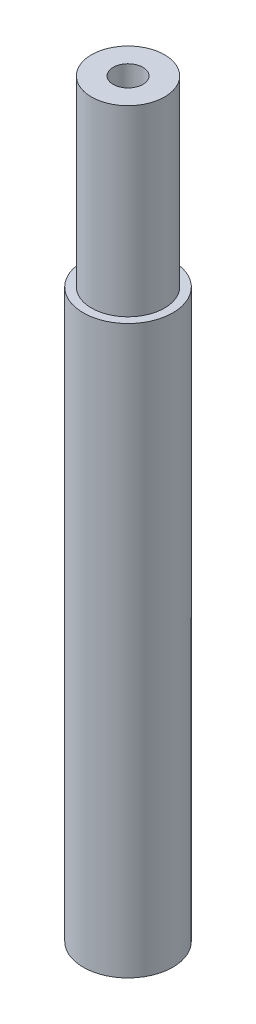
ISO-10303-21;
HEADER;
FILE_DESCRIPTION(('STEP AP214'),'2;1');
FILE_NAME('part.step','',(''),(''),'','','');
FILE_SCHEMA(('AUTOMOTIVE_DESIGN { 1 0 10303 214 1 1 1 1 }'));
ENDSEC;
DATA;
#1=APPLICATION_CONTEXT('core data for automotive mechanical design processes');
#2=APPLICATION_PROTOCOL_DEFINITION('international standard','automotive_design',2000,#1);
#3=PRODUCT_CONTEXT('',#1,'mechanical');
#4=PRODUCT('Part','Part','',(#3));
#5=PRODUCT_RELATED_PRODUCT_CATEGORY('part','',(#4));
#6=PRODUCT_DEFINITION_FORMATION('','',#4);
#7=PRODUCT_DEFINITION_CONTEXT('part definition',#1,'design');
#8=PRODUCT_DEFINITION('design','',#6,#7);
#9=PRODUCT_DEFINITION_SHAPE('','',#8);
#10=(LENGTH_UNIT() NAMED_UNIT(*) SI_UNIT(.MILLI.,.METRE.));
#11=(NAMED_UNIT(*) PLANE_ANGLE_UNIT() SI_UNIT($,.RADIAN.));
#12=(NAMED_UNIT(*) SI_UNIT($,.STERADIAN.) SOLID_ANGLE_UNIT());
#13=UNCERTAINTY_MEASURE_WITH_UNIT(LENGTH_MEASURE(1.E-05),#10,'distance_accuracy_value','');
#14=(GEOMETRIC_REPRESENTATION_CONTEXT(3) GLOBAL_UNCERTAINTY_ASSIGNED_CONTEXT((#13)) GLOBAL_UNIT_ASSIGNED_CONTEXT((#10,
#11,#12)) REPRESENTATION_CONTEXT('',''));
#15=CARTESIAN_POINT('',(0.,0.,0.));
#16=DIRECTION('',(0.,0.,1.));
#17=DIRECTION('',(1.,0.,0.));
#18=AXIS2_PLACEMENT_3D('',#15,#16,#17);
#19=CARTESIAN_POINT('',(0.,20.,0.));
#20=DIRECTION('',(0.,1.,0.));
#21=DIRECTION('',(0.,0.,1.));
#22=AXIS2_PLACEMENT_3D('',#19,#20,#21);
#23=PLANE('',#22);
#24=CARTESIAN_POINT('',(0.,20.,0.));
#25=DIRECTION('',(0.,1.,0.));
#26=DIRECTION('',(0.,0.,1.));
#27=AXIS2_PLACEMENT_3D('',#24,#25,#26);
#28=CIRCLE('',#27,4.);
#29=CARTESIAN_POINT('',(0.,20.,4.));
#30=VERTEX_POINT('',#29);
#31=EDGE_CURVE('E10',#30,#30,#28,.T.);
#32=ORIENTED_EDGE('',*,*,#31,.T.);
#33=EDGE_LOOP('',(#32));
#34=FACE_BOUND('',#33,.T.);
#35=CARTESIAN_POINT('',(0.,20.,0.));
#36=DIRECTION('',(0.,1.,0.));
#37=DIRECTION('',(0.,0.,1.));
#38=AXIS2_PLACEMENT_3D('',#35,#36,#37);
#39=CIRCLE('',#38,1.625);
#40=CARTESIAN_POINT('',(0.,20.,1.625));
#41=VERTEX_POINT('',#40);
#42=EDGE_CURVE('E46',#41,#41,#39,.T.);
#43=ORIENTED_EDGE('',*,*,#42,.F.);
#44=EDGE_LOOP('',(#43));
#45=FACE_BOUND('',#44,.T.);
#46=ADVANCED_FACE('F37',(#34,#45),#23,.T.);
#47=CARTESIAN_POINT('',(0.,20.,0.));
#48=DIRECTION('',(0.,-1.,0.));
#49=DIRECTION('',(0.,0.,-1.));
#50=AXIS2_PLACEMENT_3D('',#47,#48,#49);
#51=CYLINDRICAL_SURFACE('',#50,4.);
#52=ORIENTED_EDGE('',*,*,#31,.F.);
#53=EDGE_LOOP('',(#52));
#54=FACE_BOUND('',#53,.T.);
#55=CARTESIAN_POINT('',(0.,0.,0.));
#56=DIRECTION('',(0.,1.,0.));
#57=DIRECTION('',(0.,0.,1.));
#58=AXIS2_PLACEMENT_3D('',#55,#56,#57);
#59=CIRCLE('',#58,4.);
#60=CARTESIAN_POINT('',(0.,0.,4.));
#61=VERTEX_POINT('',#60);
#62=EDGE_CURVE('E41',#61,#61,#59,.T.);
#63=ORIENTED_EDGE('',*,*,#62,.T.);
#64=EDGE_LOOP('',(#63));
#65=FACE_BOUND('',#64,.T.);
#66=ADVANCED_FACE('F39',(#54,#65),#51,.T.);
#67=CARTESIAN_POINT('',(0.,20.,0.));
#68=DIRECTION('',(0.,-1.,0.));
#69=DIRECTION('',(0.,0.,-1.));
#70=AXIS2_PLACEMENT_3D('',#67,#68,#69);
#71=CYLINDRICAL_SURFACE('',#70,1.625);
#72=ORIENTED_EDGE('',*,*,#42,.T.);
#73=EDGE_LOOP('',(#72));
#74=FACE_BOUND('',#73,.T.);
#75=CARTESIAN_POINT('',(0.,0.,0.));
#76=DIRECTION('',(0.,1.,0.));
#77=DIRECTION('',(0.,0.,1.));
#78=AXIS2_PLACEMENT_3D('',#75,#76,#77);
#79=CIRCLE('',#78,1.625);
#80=CARTESIAN_POINT('',(0.,0.,1.625));
#81=VERTEX_POINT('',#80);
#82=EDGE_CURVE('E51',#81,#81,#79,.T.);
#83=ORIENTED_EDGE('',*,*,#82,.F.);
#84=EDGE_LOOP('',(#83));
#85=FACE_BOUND('',#84,.T.);
#86=ADVANCED_FACE('F103',(#74,#85),#71,.F.);
#87=CARTESIAN_POINT('',(0.,0.,0.));
#88=DIRECTION('',(0.,-1.,0.));
#89=DIRECTION('',(0.,0.,-1.));
#90=AXIS2_PLACEMENT_3D('',#87,#88,#89);
#91=PLANE('',#90);
#92=ORIENTED_EDGE('',*,*,#82,.T.);
#93=EDGE_LOOP('',(#92));
#94=FACE_BOUND('',#93,.T.);
#95=ADVANCED_FACE('F92',(#94),#91,.F.);
#96=CARTESIAN_POINT('',(0.,-62.,0.));
#97=DIRECTION('',(0.,1.,0.));
#98=DIRECTION('',(0.,0.,1.));
#99=AXIS2_PLACEMENT_3D('',#96,#97,#98);
#100=CYLINDRICAL_SURFACE('',#99,4.9);
#101=CARTESIAN_POINT('',(0.,-62.,0.));
#102=DIRECTION('',(0.,-1.,0.));
#103=DIRECTION('',(0.,0.,-1.));
#104=AXIS2_PLACEMENT_3D('',#101,#102,#103);
#105=CIRCLE('',#104,4.9);
#106=CARTESIAN_POINT('',(0.,-62.,-4.9));
#107=VERTEX_POINT('',#106);
#108=EDGE_CURVE('E61',#107,#107,#105,.T.);
#109=ORIENTED_EDGE('',*,*,#108,.F.);
#110=EDGE_LOOP('',(#109));
#111=FACE_BOUND('',#110,.T.);
#112=CARTESIAN_POINT('',(0.,0.,0.));
#113=DIRECTION('',(0.,-1.,0.));
#114=DIRECTION('',(0.,0.,-1.));
#115=AXIS2_PLACEMENT_3D('',#112,#113,#114);
#116=CIRCLE('',#115,4.9);
#117=CARTESIAN_POINT('',(0.,0.,-4.9));
#118=VERTEX_POINT('',#117);
#119=EDGE_CURVE('E57',#118,#118,#116,.T.);
#120=ORIENTED_EDGE('',*,*,#119,.T.);
#121=EDGE_LOOP('',(#120));
#122=FACE_BOUND('',#121,.T.);
#123=ADVANCED_FACE('F86',(#111,#122),#100,.T.);
#124=CARTESIAN_POINT('',(0.,-62.,0.));
#125=DIRECTION('',(0.,-1.,0.));
#126=DIRECTION('',(0.,0.,-1.));
#127=AXIS2_PLACEMENT_3D('',#124,#125,#126);
#128=PLANE('',#127);
#129=CARTESIAN_POINT('',(0.,-62.,0.));
#130=DIRECTION('',(0.,-1.,0.));
#131=DIRECTION('',(0.,0.,-1.));
#132=AXIS2_PLACEMENT_3D('',#129,#130,#131);
#133=CIRCLE('',#132,1.625);
#134=CARTESIAN_POINT('',(0.,-62.,-1.625));
#135=VERTEX_POINT('',#134);
#136=EDGE_CURVE('E66',#135,#135,#133,.T.);
#137=ORIENTED_EDGE('',*,*,#136,.F.);
#138=EDGE_LOOP('',(#137));
#139=FACE_BOUND('',#138,.T.);
#140=ORIENTED_EDGE('',*,*,#108,.T.);
#141=EDGE_LOOP('',(#140));
#142=FACE_BOUND('',#141,.T.);
#143=ADVANCED_FACE('F83',(#139,#142),#128,.T.);
#144=ORIENTED_EDGE('',*,*,#62,.F.);
#145=EDGE_LOOP('',(#144));
#146=FACE_BOUND('',#145,.T.);
#147=ORIENTED_EDGE('',*,*,#119,.F.);
#148=EDGE_LOOP('',(#147));
#149=FACE_BOUND('',#148,.T.);
#150=ADVANCED_FACE('F79',(#146,#149),#91,.F.);
#151=CARTESIAN_POINT('',(0.,-42.,0.));
#152=DIRECTION('',(0.,-1.,0.));
#153=DIRECTION('',(0.,0.,-1.));
#154=AXIS2_PLACEMENT_3D('',#151,#152,#153);
#155=CYLINDRICAL_SURFACE('',#154,1.625);
#156=CARTESIAN_POINT('',(0.,-42.,0.));
#157=DIRECTION('',(0.,-1.,0.));
#158=DIRECTION('',(0.,0.,-1.));
#159=AXIS2_PLACEMENT_3D('',#156,#157,#158);
#160=CIRCLE('',#159,1.625);
#161=CARTESIAN_POINT('',(0.,-42.,-1.625));
#162=VERTEX_POINT('',#161);
#163=EDGE_CURVE('E62',#162,#162,#160,.T.);
#164=ORIENTED_EDGE('',*,*,#163,.F.);
#165=EDGE_LOOP('',(#164));
#166=FACE_BOUND('',#165,.T.);
#167=ORIENTED_EDGE('',*,*,#136,.T.);
#168=EDGE_LOOP('',(#167));
#169=FACE_BOUND('',#168,.T.);
#170=ADVANCED_FACE('F76',(#166,#169),#155,.F.);
#171=CARTESIAN_POINT('',(0.,-42.,0.));
#172=DIRECTION('',(0.,-1.,0.));
#173=DIRECTION('',(0.,0.,-1.));
#174=AXIS2_PLACEMENT_3D('',#171,#172,#173);
#175=PLANE('',#174);
#176=ORIENTED_EDGE('',*,*,#163,.T.);
#177=EDGE_LOOP('',(#176));
#178=FACE_BOUND('',#177,.T.);
#179=ADVANCED_FACE('F74',(#178),#175,.T.);
#180=CLOSED_SHELL('',(#46,#66,#86,#95,#123,#143,#150,#170,#179));
#181=MANIFOLD_SOLID_BREP('B2',#180);
#182=ADVANCED_BREP_SHAPE_REPRESENTATION('',(#18,#181),#14);
#183=SHAPE_DEFINITION_REPRESENTATION(#9,#182);
ENDSEC;
END-ISO-10303-21;
